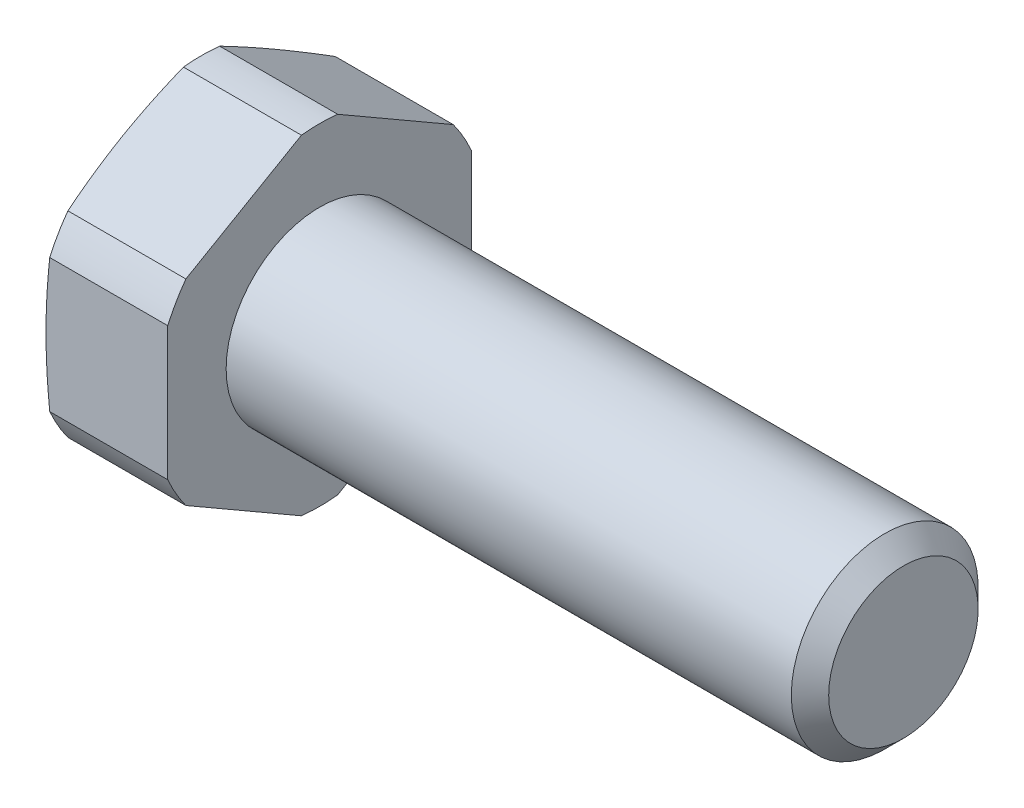
ISO-10303-21;
HEADER;
FILE_DESCRIPTION(('STEP AP214'),'2;1');
FILE_NAME('part.step','',(''),(''),'','','');
FILE_SCHEMA(('AUTOMOTIVE_DESIGN { 1 0 10303 214 1 1 1 1 }'));
ENDSEC;
DATA;
#1=APPLICATION_CONTEXT('core data for automotive mechanical design processes');
#2=APPLICATION_PROTOCOL_DEFINITION('international standard','automotive_design',2000,#1);
#3=PRODUCT_CONTEXT('',#1,'mechanical');
#4=PRODUCT('Part','Part','',(#3));
#5=PRODUCT_RELATED_PRODUCT_CATEGORY('part','',(#4));
#6=PRODUCT_DEFINITION_FORMATION('','',#4);
#7=PRODUCT_DEFINITION_CONTEXT('part definition',#1,'design');
#8=PRODUCT_DEFINITION('design','',#6,#7);
#9=PRODUCT_DEFINITION_SHAPE('','',#8);
#10=(LENGTH_UNIT() NAMED_UNIT(*) SI_UNIT(.MILLI.,.METRE.));
#11=(NAMED_UNIT(*) PLANE_ANGLE_UNIT() SI_UNIT($,.RADIAN.));
#12=(NAMED_UNIT(*) SI_UNIT($,.STERADIAN.) SOLID_ANGLE_UNIT());
#13=UNCERTAINTY_MEASURE_WITH_UNIT(LENGTH_MEASURE(1.E-05),#10,'distance_accuracy_value','');
#14=(GEOMETRIC_REPRESENTATION_CONTEXT(3) GLOBAL_UNCERTAINTY_ASSIGNED_CONTEXT((#13)) GLOBAL_UNIT_ASSIGNED_CONTEXT((#10,
#11,#12)) REPRESENTATION_CONTEXT('',''));
#15=CARTESIAN_POINT('',(0.,0.,0.));
#16=DIRECTION('',(0.,0.,1.));
#17=DIRECTION('',(1.,0.,0.));
#18=AXIS2_PLACEMENT_3D('',#15,#16,#17);
#19=CARTESIAN_POINT('',(-5.05214699700121,0.,0.));
#20=DIRECTION('',(1.,0.,0.));
#21=DIRECTION('',(0.,0.,-1.));
#22=AXIS2_PLACEMENT_3D('',#19,#20,#21);
#23=CONICAL_SURFACE('',#22,7.1,1.30899693899575);
#24=CARTESIAN_POINT('',(-5.3,0.,0.));
#25=DIRECTION('',(-1.,0.,0.));
#26=DIRECTION('',(0.,0.,1.));
#27=AXIS2_PLACEMENT_3D('',#24,#25,#26);
#28=CIRCLE('',#27,6.175);
#29=CARTESIAN_POINT('',(-5.3,0.,6.17500000000001));
#30=VERTEX_POINT('',#29);
#31=EDGE_CURVE('E136',#30,#30,#28,.T.);
#32=ORIENTED_EDGE('',*,*,#31,.F.);
#33=EDGE_LOOP('',(#32));
#34=FACE_BOUND('',#33,.T.);
#35=CARTESIAN_POINT('',(-5.05194699700121,4.19995209101871,-5.72546958900048));
#36=CARTESIAN_POINT('',(-5.07760027496934,4.31878271807584,-5.51964890544198));
#37=CARTESIAN_POINT('',(-5.10057398869215,4.43776618363337,-5.31356349783559));
#38=CARTESIAN_POINT('',(-5.14056478113447,4.67600028246664,-4.9009299345609));
#39=CARTESIAN_POINT('',(-5.15758094438379,4.79525095397173,-4.6943817126774));
#40=CARTESIAN_POINT('',(-5.18500732267837,5.03356593868456,-4.2816080509498));
#41=CARTESIAN_POINT('',(-5.19543831566373,5.15262964360163,-4.07538366469604));
#42=CARTESIAN_POINT('',(-5.20939266077504,5.39085061213858,-3.66277284376177));
#43=CARTESIAN_POINT('',(-5.21291651245995,5.51000786836872,-3.45638642188067));
#44=CARTESIAN_POINT('',(-5.21291651245994,5.748322380829,-3.04361357811845));
#45=CARTESIAN_POINT('',(-5.20939266077503,5.86747963705914,-2.83722715623734));
#46=CARTESIAN_POINT('',(-5.19543831566371,6.1057006055961,-2.42461633530308));
#47=CARTESIAN_POINT('',(-5.18500732267833,6.22476431051317,-2.21839194904933));
#48=CARTESIAN_POINT('',(-5.15758094438374,6.46307929522598,-1.80561828732172));
#49=CARTESIAN_POINT('',(-5.14056478113442,6.58232996673106,-1.59907006543821));
#50=CARTESIAN_POINT('',(-5.10057398869209,6.82056406556438,-1.18643650216356));
#51=CARTESIAN_POINT('',(-5.07760027496928,6.939547531122,-0.980351094557216));
#52=CARTESIAN_POINT('',(-5.05194699700116,7.05837815817933,-0.774530410998828));
#53=B_SPLINE_CURVE_WITH_KNOTS('',3,(#35,#36,#37,#38,#39,#40,#41,#42,#43,#44,#45,#46,#47,#48,#49,
#50,#51,#52),.UNSPECIFIED.,.F.,.F.,(4,2,2,2,2,2,2,2,4),(0.,0.717134619479373,1.43437938951788,
2.14934960199482,2.86426810234601,3.57918660269719,4.29415681517413,5.01140158521264,
5.72853620469201),.UNSPECIFIED.);
#54=CARTESIAN_POINT('',(-5.05214699700121,4.20087943889028,-5.72386337537059));
#55=VERTEX_POINT('',#54);
#56=CARTESIAN_POINT('',(-5.05214699700121,7.05745081030744,-0.776136624629012));
#57=VERTEX_POINT('',#56);
#58=EDGE_CURVE('E208',#55,#57,#53,.T.);
#59=ORIENTED_EDGE('',*,*,#58,.F.);
#60=CARTESIAN_POINT('',(-5.05214699700121,0.,0.));
#61=DIRECTION('',(-1.,0.,0.));
#62=DIRECTION('',(0.,0.,1.));
#63=AXIS2_PLACEMENT_3D('',#60,#61,#62);
#64=CIRCLE('',#63,7.1);
#65=CARTESIAN_POINT('',(-5.05214699700121,2.85657137141702,-6.4999999999998));
#66=VERTEX_POINT('',#65);
#67=EDGE_CURVE('E291',#55,#66,#64,.T.);
#68=ORIENTED_EDGE('',*,*,#67,.T.);
#69=CARTESIAN_POINT('',(-3.77950089472176,-9.90770125370262,-6.49999999999994));
#70=CARTESIAN_POINT('',(-3.84549923221781,-9.61303683004892,-6.49999999999971));
#71=CARTESIAN_POINT('',(-3.9106870830531,-9.31818755285972,-6.49999999999963));
#72=CARTESIAN_POINT('',(-4.03900435606368,-8.72802854950372,-6.49999999999956));
#73=CARTESIAN_POINT('',(-4.10213368872083,-8.43271880389624,-6.49999999999958));
#74=CARTESIAN_POINT('',(-4.22595195035637,-7.84128094408389,-6.4999999999996));
#75=CARTESIAN_POINT('',(-4.28663840023632,-7.54515230901562,-6.49999999999959));
#76=CARTESIAN_POINT('',(-4.40491269371641,-6.95227722725175,-6.49999999999959));
#77=CARTESIAN_POINT('',(-4.4625005636794,-6.65553078583479,-6.49999999999959));
#78=CARTESIAN_POINT('',(-4.57339453337865,-6.06368986807942,-6.49999999999959));
#79=CARTESIAN_POINT('',(-4.62673117435121,-5.76860114266193,-6.49999999999959));
#80=CARTESIAN_POINT('',(-4.72872616796684,-5.17761769171756,-6.49999999999959));
#81=CARTESIAN_POINT('',(-4.77738462407631,-4.88172298416532,-6.49999999999961));
#82=CARTESIAN_POINT('',(-4.86892350982998,-4.28907239039303,-6.49999999999958));
#83=CARTESIAN_POINT('',(-4.91180468331163,-3.99231662007223,-6.49999999999953));
#84=CARTESIAN_POINT('',(-4.99052177949509,-3.39786141661485,-6.49999999999965));
#85=CARTESIAN_POINT('',(-5.02635769642819,-3.10016198270579,-6.49999999999981));
#86=CARTESIAN_POINT('',(-5.08996536212495,-2.50046834328475,-6.49999999999981));
#87=CARTESIAN_POINT('',(-5.11764085308351,-2.19846377390432,-6.49999999999965));
#88=CARTESIAN_POINT('',(-5.16301575116542,-1.59369968950727,-6.49999999999953));
#89=CARTESIAN_POINT('',(-5.18071538706173,-1.29094019196311,-6.49999999999958));
#90=CARTESIAN_POINT('',(-5.20510605570851,-0.685105061534446,-6.49999999999961));
#91=CARTESIAN_POINT('',(-5.21180202439845,-0.382029631451896,-6.4999999999996));
#92=CARTESIAN_POINT('',(-5.21377415859091,0.224158974521434,-6.49999999999959));
#93=CARTESIAN_POINT('',(-5.20905033033124,0.527272150391506,-6.49999999999959));
#94=CARTESIAN_POINT('',(-5.18844845784139,1.13421773965112,-6.49999999999959));
#95=CARTESIAN_POINT('',(-5.17252981467405,1.43804874687813,-6.49999999999959));
#96=CARTESIAN_POINT('',(-5.13044490350307,2.04499361527503,-6.49999999999959));
#97=CARTESIAN_POINT('',(-5.10427841006827,2.34810746052128,-6.49999999999961));
#98=CARTESIAN_POINT('',(-5.04301462259288,2.95361619476181,-6.49999999999957));
#99=CARTESIAN_POINT('',(-5.00791153851854,3.25601048886066,-6.49999999999953));
#100=CARTESIAN_POINT('',(-4.93022920552256,3.85982662819234,-6.49999999999965));
#101=CARTESIAN_POINT('',(-4.88764993371117,4.16124847044493,-6.4999999999998));
#102=CARTESIAN_POINT('',(-4.79942061262062,4.74304526391531,-6.49999999999979));
#103=CARTESIAN_POINT('',(-4.75416585471337,5.02348076975651,-6.49999999999964));
#104=CARTESIAN_POINT('',(-4.65928179773914,5.58361433540157,-6.49999999999954));
#105=CARTESIAN_POINT('',(-4.60965238023534,5.86331237502846,-6.49999999999958));
#106=CARTESIAN_POINT('',(-4.50681836335416,6.42207301698542,-6.4999999999996));
#107=CARTESIAN_POINT('',(-4.45361344604542,6.70113556052046,-6.49999999999959));
#108=CARTESIAN_POINT('',(-4.34428024606986,7.25868877975134,-6.49999999999959));
#109=CARTESIAN_POINT('',(-4.28815192576304,7.53717944803604,-6.49999999999959));
#110=CARTESIAN_POINT('',(-4.1161751327369,8.37203815656093,-6.49999999999959));
#111=CARTESIAN_POINT('',(-3.9967579068585,8.92767029566493,-6.49999999999959));
#112=CARTESIAN_POINT('',(-3.75146990372675,10.0374595472311,-6.49999999999959));
#113=CARTESIAN_POINT('',(-3.62559950106506,10.5916167433504,-6.49999999999959));
#114=CARTESIAN_POINT('',(-3.37057620947709,11.6934057001811,-6.49999999999959));
#115=CARTESIAN_POINT('',(-3.24146803677526,12.2410478396252,-6.49999999999959));
#116=CARTESIAN_POINT('',(-2.98002169310481,13.3355686749826,-6.49999999999959));
#117=CARTESIAN_POINT('',(-2.8476834637139,13.8824473568976,-6.4999999999996));
#118=CARTESIAN_POINT('',(-2.58078319258942,14.9749505577545,-6.49999999999958));
#119=CARTESIAN_POINT('',(-2.44622407444435,15.5205757923582,-6.49999999999955));
#120=CARTESIAN_POINT('',(-2.17526847677977,16.611351157403,-6.49999999999962));
#121=CARTESIAN_POINT('',(-2.03887205773513,17.1565013028558,-6.49999999999972));
#122=CARTESIAN_POINT('',(-1.90182465532042,17.7014857538417,-6.49999999999996));
#123=B_SPLINE_CURVE_WITH_KNOTS('',3,(#69,#70,#71,#72,#73,#74,#75,#76,#77,#78,#79,#80,#81,#82,
#83,#84,#85,#86,#87,#88,#89,#90,#91,#92,#93,#94,#95,#96,#97,#98,#99,#100,#101,#102,#103,#104,
#105,#106,#107,#108,#109,#110,#111,#112,#113,#114,#115,#116,#117,#118,#119,#120,#121,#122),
.UNSPECIFIED.,.F.,.F.,(4,2,2,2,2,2,2,2,2,2,2,2,2,2,2,2,2,2,2,2,2,2,2,2,2,2,4),(0.,
0.905898920692884,1.81183718353165,2.71867275809952,3.62550061605081,4.52508121778619,
5.4246419191147,6.3240866891773,7.22353219570955,8.13319785926563,9.0428426609137,
9.95207930967695,10.8613154617895,11.7738661542407,12.6864369220163,13.5996004575466,
14.5127667889475,15.3649164610578,16.2170892108291,17.0693378358233,17.9215974365788,
19.6264908547874,21.3312854197707,23.0192370587519,24.7072192505043,26.3931331153492,
28.0789916231747),.UNSPECIFIED.);
#124=CARTESIAN_POINT('',(-5.05214699700124,-2.85657137141709,-6.49999999999971));
#125=VERTEX_POINT('',#124);
#126=EDGE_CURVE('E187',#125,#66,#123,.T.);
#127=ORIENTED_EDGE('',*,*,#126,.F.);
#128=CARTESIAN_POINT('',(-5.05214699700124,-4.20087943889029,-5.72386337537037));
#129=VERTEX_POINT('',#128);
#130=EDGE_CURVE('E186',#125,#129,#64,.T.);
#131=ORIENTED_EDGE('',*,*,#130,.T.);
#132=CARTESIAN_POINT('',(-5.05194699700121,-7.0583781581794,-0.7745304109988));
#133=CARTESIAN_POINT('',(-5.07760027496929,-6.93954753112202,-0.980351094557168));
#134=CARTESIAN_POINT('',(-5.10057398869209,-6.82056406556439,-1.1864365021635));
#135=CARTESIAN_POINT('',(-5.14056478113441,-6.58232996673104,-1.59907006543815));
#136=CARTESIAN_POINT('',(-5.15758094438374,-6.46307929522597,-1.80561828732167));
#137=CARTESIAN_POINT('',(-5.18500732267834,-6.22476431051316,-2.21839194904928));
#138=CARTESIAN_POINT('',(-5.19543831566371,-6.10570060559608,-2.42461633530304));
#139=CARTESIAN_POINT('',(-5.20939266077503,-5.86747963705913,-2.83722715623731));
#140=CARTESIAN_POINT('',(-5.21291651245994,-5.74832238082899,-3.04361357811842));
#141=CARTESIAN_POINT('',(-5.21291651245995,-5.5100078683687,-3.45638642188064));
#142=CARTESIAN_POINT('',(-5.20939266077504,-5.39085061213856,-3.66277284376175));
#143=CARTESIAN_POINT('',(-5.19543831566374,-5.15262964360161,-4.07538366469602));
#144=CARTESIAN_POINT('',(-5.18500732267838,-5.03356593868453,-4.28160805094978));
#145=CARTESIAN_POINT('',(-5.1575809443838,-4.79525095397171,-4.69438171267738));
#146=CARTESIAN_POINT('',(-5.14056478113448,-4.67600028246661,-4.90092993456089));
#147=CARTESIAN_POINT('',(-5.10057398869216,-4.43776618363333,-5.31356349783558));
#148=CARTESIAN_POINT('',(-5.07760027496935,-4.31878271807578,-5.51964890544196));
#149=CARTESIAN_POINT('',(-5.05194699700124,-4.1999520910186,-5.72546958900044));
#150=B_SPLINE_CURVE_WITH_KNOTS('',3,(#132,#133,#134,#135,#136,#137,#138,#139,#140,#141,#142,
#143,#144,#145,#146,#147,#148,#149),.UNSPECIFIED.,.F.,.F.,(4,2,2,2,2,2,2,2,4),(0.,
0.717134619479379,1.43437938951789,2.14934960199484,2.86426810234604,3.57918660269723,
4.29415681517419,5.0114015852127,5.72853620469208),.UNSPECIFIED.);
#151=CARTESIAN_POINT('',(-5.05214699700127,-7.05745081030751,-0.776136624629192));
#152=VERTEX_POINT('',#151);
#153=EDGE_CURVE('E273',#152,#129,#150,.T.);
#154=ORIENTED_EDGE('',*,*,#153,.F.);
#155=CARTESIAN_POINT('',(-5.05214699700124,-7.05745081030741,0.7761366246294));
#156=VERTEX_POINT('',#155);
#157=EDGE_CURVE('E293',#152,#156,#64,.T.);
#158=ORIENTED_EDGE('',*,*,#157,.T.);
#159=CARTESIAN_POINT('',(-5.05194699700124,-4.19995209101867,5.72546958900051));
#160=CARTESIAN_POINT('',(-5.07760027496929,-4.318782718076,5.51964890544213));
#161=CARTESIAN_POINT('',(-5.10057398869207,-4.43776618363361,5.3135634978358));
#162=CARTESIAN_POINT('',(-5.14056478113436,-4.67600028246691,4.90092993456117));
#163=CARTESIAN_POINT('',(-5.15758094438369,-4.79525095397198,4.69438171267767));
#164=CARTESIAN_POINT('',(-5.18500732267827,-5.03356593868478,4.2816080509501));
#165=CARTESIAN_POINT('',(-5.19543831566363,-5.15262964360184,4.07538366469635));
#166=CARTESIAN_POINT('',(-5.20939266077494,-5.39085061213878,3.66277284376211));
#167=CARTESIAN_POINT('',(-5.21291651245985,-5.51000786836892,3.45638642188102));
#168=CARTESIAN_POINT('',(-5.21291651245984,-5.74832238082918,3.04361357811883));
#169=CARTESIAN_POINT('',(-5.20939266077493,-5.86747963705932,2.83722715623774));
#170=CARTESIAN_POINT('',(-5.19543831566362,-6.10570060559625,2.4246163353035));
#171=CARTESIAN_POINT('',(-5.18500732267825,-6.22476431051332,2.21839194904976));
#172=CARTESIAN_POINT('',(-5.15758094438367,-6.46307929522612,1.80561828732218));
#173=CARTESIAN_POINT('',(-5.14056478113434,-6.58232996673119,1.59907006543868));
#174=CARTESIAN_POINT('',(-5.10057398869203,-6.82056406556449,1.18643650216405));
#175=CARTESIAN_POINT('',(-5.07760027496925,-6.93954753112208,0.980351094557713));
#176=CARTESIAN_POINT('',(-5.05194699700118,-7.05837815817938,0.774530410999313));
#177=B_SPLINE_CURVE_WITH_KNOTS('',3,(#159,#160,#161,#162,#163,#164,#165,#166,#167,#168,#169,
#170,#171,#172,#173,#174,#175,#176),.UNSPECIFIED.,.F.,.F.,(4,2,2,2,2,2,2,2,4),(0.,
0.717134619479323,1.43437938951778,2.14934960199468,2.86426810234581,3.57918660269695,
4.29415681517385,5.01140158521231,5.72853620469163),.UNSPECIFIED.);
#178=CARTESIAN_POINT('',(-5.05214699700124,-4.20087943889028,5.72386337537056));
#179=VERTEX_POINT('',#178);
#180=EDGE_CURVE('E262',#179,#156,#177,.T.);
#181=ORIENTED_EDGE('',*,*,#180,.F.);
#182=CARTESIAN_POINT('',(-5.05214699700124,-2.85657137141719,6.50000000000008));
#183=VERTEX_POINT('',#182);
#184=EDGE_CURVE('E154',#179,#183,#64,.T.);
#185=ORIENTED_EDGE('',*,*,#184,.T.);
#186=CARTESIAN_POINT('',(-3.77950089472174,-9.90770125370274,6.50000000000027));
#187=CARTESIAN_POINT('',(-3.84549923221772,-9.61303683004902,6.5000000000003));
#188=CARTESIAN_POINT('',(-3.91068708305298,-9.31818755285982,6.50000000000031));
#189=CARTESIAN_POINT('',(-4.03900435606353,-8.72802854950381,6.50000000000032));
#190=CARTESIAN_POINT('',(-4.10213368872069,-8.43271880389633,6.50000000000031));
#191=CARTESIAN_POINT('',(-4.22595195035623,-7.84128094408398,6.50000000000031));
#192=CARTESIAN_POINT('',(-4.28663840023618,-7.5451523090157,6.50000000000031));
#193=CARTESIAN_POINT('',(-4.40491269371626,-6.95227722725182,6.50000000000031));
#194=CARTESIAN_POINT('',(-4.46250056367925,-6.65553078583486,6.50000000000031));
#195=CARTESIAN_POINT('',(-4.5733945333785,-6.06368986807948,6.50000000000031));
#196=CARTESIAN_POINT('',(-4.62673117435105,-5.76860114266198,6.50000000000031));
#197=CARTESIAN_POINT('',(-4.72872616796669,-5.1776176917176,6.50000000000031));
#198=CARTESIAN_POINT('',(-4.77738462407616,-4.88172298416536,6.50000000000031));
#199=CARTESIAN_POINT('',(-4.8689235098298,-4.28907239039307,6.50000000000031));
#200=CARTESIAN_POINT('',(-4.9118046833114,-3.99231662007226,6.50000000000033));
#201=CARTESIAN_POINT('',(-4.99052177949497,-3.39786141661488,6.5000000000003));
#202=CARTESIAN_POINT('',(-5.02635769642822,-3.10016198270584,6.50000000000026));
#203=CARTESIAN_POINT('',(-5.08996536212497,-2.50046834328482,6.50000000000025));
#204=CARTESIAN_POINT('',(-5.11764085308337,-2.19846377390439,6.50000000000029));
#205=CARTESIAN_POINT('',(-5.16301575116517,-1.59369968950734,6.50000000000032));
#206=CARTESIAN_POINT('',(-5.18071538706152,-1.29094019196319,6.50000000000031));
#207=CARTESIAN_POINT('',(-5.20510605570833,-0.685105061534552,6.50000000000031));
#208=CARTESIAN_POINT('',(-5.21180202439826,-0.382029631452007,6.50000000000031));
#209=CARTESIAN_POINT('',(-5.21377415859071,0.22415897452131,6.50000000000031));
#210=CARTESIAN_POINT('',(-5.20905033033105,0.527272150391373,6.50000000000031));
#211=CARTESIAN_POINT('',(-5.18844845784121,1.13421773965097,6.50000000000031));
#212=CARTESIAN_POINT('',(-5.17252981467387,1.43804874687797,6.50000000000031));
#213=CARTESIAN_POINT('',(-5.1304449035029,2.04499361527486,6.50000000000031));
#214=CARTESIAN_POINT('',(-5.10427841006811,2.34810746052111,6.5000000000003));
#215=CARTESIAN_POINT('',(-5.04301462259272,2.95361619476162,6.50000000000032));
#216=CARTESIAN_POINT('',(-5.00791153851836,3.25601048886047,6.50000000000034));
#217=CARTESIAN_POINT('',(-4.93022920552246,3.85982662819214,6.50000000000028));
#218=CARTESIAN_POINT('',(-4.88764993371117,4.16124847044474,6.5000000000002));
#219=CARTESIAN_POINT('',(-4.79942061262062,4.7430452639151,6.5000000000002));
#220=CARTESIAN_POINT('',(-4.75416585471329,5.02348076975629,6.50000000000028));
#221=CARTESIAN_POINT('',(-4.659281797739,5.58361433540135,6.50000000000034));
#222=CARTESIAN_POINT('',(-4.60965238023523,5.86331237502824,6.50000000000032));
#223=CARTESIAN_POINT('',(-4.50681836335407,6.4220730169852,6.5000000000003));
#224=CARTESIAN_POINT('',(-4.45361344604533,6.70113556052025,6.50000000000031));
#225=CARTESIAN_POINT('',(-4.34428024606977,7.25868877975113,6.50000000000031));
#226=CARTESIAN_POINT('',(-4.28815192576295,7.53717944803583,6.50000000000031));
#227=CARTESIAN_POINT('',(-4.11617513273683,8.37203815656074,6.50000000000031));
#228=CARTESIAN_POINT('',(-3.99675790685842,8.92767029566475,6.50000000000031));
#229=CARTESIAN_POINT('',(-3.75146990372668,10.037459547231,6.50000000000031));
#230=CARTESIAN_POINT('',(-3.62559950106499,10.5916167433502,6.50000000000031));
#231=CARTESIAN_POINT('',(-3.37057620947703,11.6934057001809,6.50000000000031));
#232=CARTESIAN_POINT('',(-3.2414680367752,12.2410478396251,6.50000000000031));
#233=CARTESIAN_POINT('',(-2.98002169310476,13.3355686749824,6.5000000000003));
#234=CARTESIAN_POINT('',(-2.84768346371385,13.8824473568974,6.5000000000003));
#235=CARTESIAN_POINT('',(-2.58078319258937,14.9749505577543,6.50000000000031));
#236=CARTESIAN_POINT('',(-2.44622407444431,15.5205757923581,6.50000000000033));
#237=CARTESIAN_POINT('',(-2.17526847677973,16.6113511574029,6.50000000000029));
#238=CARTESIAN_POINT('',(-2.03887205773509,17.1565013028557,6.50000000000023));
#239=CARTESIAN_POINT('',(-1.9018246553204,17.7014857538416,6.50000000000009));
#240=B_SPLINE_CURVE_WITH_KNOTS('',3,(#186,#187,#188,#189,#190,#191,#192,#193,#194,#195,#196,
#197,#198,#199,#200,#201,#202,#203,#204,#205,#206,#207,#208,#209,#210,#211,#212,#213,#214,#215,
#216,#217,#218,#219,#220,#221,#222,#223,#224,#225,#226,#227,#228,#229,#230,#231,#232,#233,#234,
#235,#236,#237,#238,#239),.UNSPECIFIED.,.F.,.F.,(4,2,2,2,2,2,2,2,2,2,2,2,2,2,2,2,2,2,2,2,2,2,2,
2,2,2,4),(0.,0.905898920692886,1.81183718353166,2.71867275809954,3.62550061605085,
4.52508121778624,5.42464191911476,6.32408668917736,7.22353219570961,8.13319785926565,
9.0428426609137,9.95207930967693,10.8613154617895,11.7738661542407,12.6864369220162,
13.5996004575465,14.5127667889474,15.3649164610576,16.217089210829,17.0693378358232,
17.9215974365786,19.6264908547873,21.3312854197706,23.0192370587518,24.7072192505043,
26.3931331153492,28.0789916231746),.UNSPECIFIED.);
#241=CARTESIAN_POINT('',(-5.05214699700121,2.85657137141719,6.50000000000014));
#242=VERTEX_POINT('',#241);
#243=EDGE_CURVE('E245',#242,#183,#240,.F.);
#244=ORIENTED_EDGE('',*,*,#243,.F.);
#245=CARTESIAN_POINT('',(-5.05214699700121,4.20087943889034,5.72386337537067));
#246=VERTEX_POINT('',#245);
#247=EDGE_CURVE('E162',#242,#246,#64,.T.);
#248=ORIENTED_EDGE('',*,*,#247,.T.);
#249=CARTESIAN_POINT('',(-5.05194699700116,7.05837815817938,0.774530410999077));
#250=CARTESIAN_POINT('',(-5.07760027496923,6.93954753112216,0.980351094557536));
#251=CARTESIAN_POINT('',(-5.10057398869202,6.8205640655646,1.1864365021639));
#252=CARTESIAN_POINT('',(-5.14056478113432,6.58232996673131,1.59907006543857));
#253=CARTESIAN_POINT('',(-5.15758094438365,6.46307929522623,1.80561828732208));
#254=CARTESIAN_POINT('',(-5.18500732267824,6.22476431051341,2.21839194904967));
#255=CARTESIAN_POINT('',(-5.19543831566361,6.10570060559634,2.42461633530342));
#256=CARTESIAN_POINT('',(-5.20939266077493,5.86747963705939,2.83722715623769));
#257=CARTESIAN_POINT('',(-5.21291651245984,5.74832238082925,3.04361357811879));
#258=CARTESIAN_POINT('',(-5.21291651245984,5.51000786836897,3.456386421881));
#259=CARTESIAN_POINT('',(-5.20939266077493,5.39085061213883,3.66277284376211));
#260=CARTESIAN_POINT('',(-5.19543831566363,5.15262964360188,4.07538366469637));
#261=CARTESIAN_POINT('',(-5.18500732267826,5.03356593868481,4.28160805095012));
#262=CARTESIAN_POINT('',(-5.15758094438368,4.795250953972,4.69438171267772));
#263=CARTESIAN_POINT('',(-5.14056478113436,4.67600028246693,4.90092993456123));
#264=CARTESIAN_POINT('',(-5.10057398869206,4.43776618363361,5.31356349783588));
#265=CARTESIAN_POINT('',(-5.07760027496927,4.318782718076,5.51964890544222));
#266=CARTESIAN_POINT('',(-5.05194699700121,4.19995209101869,5.72546958900062));
#267=B_SPLINE_CURVE_WITH_KNOTS('',3,(#249,#250,#251,#252,#253,#254,#255,#256,#257,#258,#259,
#260,#261,#262,#263,#264,#265,#266),.UNSPECIFIED.,.F.,.F.,(4,2,2,2,2,2,2,2,4),(0.,
0.717134619479359,1.43437938951785,2.14934960199479,2.86426810234596,3.57918660269714,
4.29415681517408,5.01140158521257,5.72853620469193),.UNSPECIFIED.);
#268=CARTESIAN_POINT('',(-5.05214699700121,7.05745081030745,0.776136624629484));
#269=VERTEX_POINT('',#268);
#270=EDGE_CURVE('E146',#269,#246,#267,.T.);
#271=ORIENTED_EDGE('',*,*,#270,.F.);
#272=EDGE_CURVE('E145',#269,#57,#64,.T.);
#273=ORIENTED_EDGE('',*,*,#272,.T.);
#274=EDGE_LOOP('',(#59,#68,#127,#131,#154,#158,#181,#185,#244,#248,#271,#273));
#275=FACE_BOUND('',#274,.T.);
#276=ADVANCED_FACE('F37',(#34,#275),#23,.T.);
#277=CARTESIAN_POINT('',(-1000.,-4.30211422042248E-13,1.11022302462516E-13));
#278=DIRECTION('',(-1.,0.,0.));
#279=DIRECTION('',(0.,0.,1.));
#280=AXIS2_PLACEMENT_3D('',#277,#278,#279);
#281=CYLINDRICAL_SURFACE('',#280,7.1);
#282=DIRECTION('',(-1.,0.,0.));
#283=VECTOR('',#282,1.);
#284=CARTESIAN_POINT('',(-1000.,4.20087943888968,-5.72386337537037));
#285=LINE('',#284,#283);
#286=CARTESIAN_POINT('',(0.,4.20087943889026,-5.72386337537043));
#287=VERTEX_POINT('',#286);
#288=EDGE_CURVE('E217',#287,#55,#285,.T.);
#289=ORIENTED_EDGE('',*,*,#288,.F.);
#290=CARTESIAN_POINT('',(0.,0.,0.));
#291=DIRECTION('',(-1.,0.,0.));
#292=DIRECTION('',(0.,0.,1.));
#293=AXIS2_PLACEMENT_3D('',#290,#291,#292);
#294=CIRCLE('',#293,7.1);
#295=CARTESIAN_POINT('',(0.,2.85657137141697,-6.49999999999974));
#296=VERTEX_POINT('',#295);
#297=EDGE_CURVE('E152',#287,#296,#294,.T.);
#298=ORIENTED_EDGE('',*,*,#297,.T.);
#299=DIRECTION('',(-1.,0.,0.));
#300=VECTOR('',#299,1.);
#301=CARTESIAN_POINT('',(-1000.,2.85657137141666,-6.49999999999973));
#302=LINE('',#301,#300);
#303=EDGE_CURVE('E178',#66,#296,#302,.F.);
#304=ORIENTED_EDGE('',*,*,#303,.F.);
#305=ORIENTED_EDGE('',*,*,#67,.F.);
#306=EDGE_LOOP('',(#289,#298,#304,#305));
#307=FACE_BOUND('',#306,.T.);
#308=ADVANCED_FACE('F292',(#307),#281,.T.);
#309=DIRECTION('',(-1.,0.,0.));
#310=VECTOR('',#309,1.);
#311=CARTESIAN_POINT('',(-1000.,7.05745081030695,-0.776136624629151));
#312=LINE('',#311,#310);
#313=CARTESIAN_POINT('',(0.,7.0574508103074,-0.776136624629262));
#314=VERTEX_POINT('',#313);
#315=EDGE_CURVE('E284',#57,#314,#312,.F.);
#316=ORIENTED_EDGE('',*,*,#315,.F.);
#317=ORIENTED_EDGE('',*,*,#272,.F.);
#318=DIRECTION('',(-1.,0.,0.));
#319=VECTOR('',#318,1.);
#320=CARTESIAN_POINT('',(-1000.,7.05745081030688,0.776136624629623));
#321=LINE('',#320,#319);
#322=CARTESIAN_POINT('',(0.,7.05745081030745,0.7761366246294));
#323=VERTEX_POINT('',#322);
#324=EDGE_CURVE('E127',#323,#269,#321,.T.);
#325=ORIENTED_EDGE('',*,*,#324,.F.);
#326=EDGE_CURVE('E143',#323,#314,#294,.T.);
#327=ORIENTED_EDGE('',*,*,#326,.T.);
#328=EDGE_LOOP('',(#316,#317,#325,#327));
#329=FACE_BOUND('',#328,.T.);
#330=ADVANCED_FACE('F142',(#329),#281,.T.);
#331=DIRECTION('',(-1.,0.,0.));
#332=VECTOR('',#331,1.);
#333=CARTESIAN_POINT('',(-1000.,-2.8565713714177,-6.49999999999967));
#334=LINE('',#333,#332);
#335=CARTESIAN_POINT('',(0.,-2.85657137141711,-6.49999999999971));
#336=VERTEX_POINT('',#335);
#337=EDGE_CURVE('E175',#336,#125,#334,.T.);
#338=ORIENTED_EDGE('',*,*,#337,.F.);
#339=CARTESIAN_POINT('',(0.,-4.20087943889043,-5.72386337537043));
#340=VERTEX_POINT('',#339);
#341=EDGE_CURVE('E157',#336,#340,#294,.T.);
#342=ORIENTED_EDGE('',*,*,#341,.T.);
#343=DIRECTION('',(-1.,0.,0.));
#344=VECTOR('',#343,1.);
#345=CARTESIAN_POINT('',(-1000.,-4.20087943889085,-5.72386337537036));
#346=LINE('',#345,#344);
#347=EDGE_CURVE('E268',#129,#340,#346,.F.);
#348=ORIENTED_EDGE('',*,*,#347,.F.);
#349=ORIENTED_EDGE('',*,*,#130,.F.);
#350=EDGE_LOOP('',(#338,#342,#348,#349));
#351=FACE_BOUND('',#350,.T.);
#352=ADVANCED_FACE('F183',(#351),#281,.T.);
#353=DIRECTION('',(-1.,0.,0.));
#354=VECTOR('',#353,1.);
#355=CARTESIAN_POINT('',(-1000.,-7.05745081030791,-0.776136624629137));
#356=LINE('',#355,#354);
#357=CARTESIAN_POINT('',(0.,-7.05745081030745,-0.776136624629262));
#358=VERTEX_POINT('',#357);
#359=EDGE_CURVE('E271',#358,#152,#356,.T.);
#360=ORIENTED_EDGE('',*,*,#359,.F.);
#361=CARTESIAN_POINT('',(0.,-7.05745081030741,0.7761366246294));
#362=VERTEX_POINT('',#361);
#363=EDGE_CURVE('E191',#358,#362,#294,.T.);
#364=ORIENTED_EDGE('',*,*,#363,.T.);
#365=DIRECTION('',(-1.,0.,0.));
#366=VECTOR('',#365,1.);
#367=CARTESIAN_POINT('',(-1000.,-7.05745081030794,0.776136624629623));
#368=LINE('',#367,#366);
#369=EDGE_CURVE('E60',#156,#362,#368,.F.);
#370=ORIENTED_EDGE('',*,*,#369,.F.);
#371=ORIENTED_EDGE('',*,*,#157,.F.);
#372=EDGE_LOOP('',(#360,#364,#370,#371));
#373=FACE_BOUND('',#372,.T.);
#374=ADVANCED_FACE('F312',(#373),#281,.T.);
#375=DIRECTION('',(-1.,0.,0.));
#376=VECTOR('',#375,1.);
#377=CARTESIAN_POINT('',(-1000.,-4.20087943889082,5.72386337537094));
#378=LINE('',#377,#376);
#379=CARTESIAN_POINT('',(0.,-4.2008794388903,5.72386337537058));
#380=VERTEX_POINT('',#379);
#381=EDGE_CURVE('E269',#380,#179,#378,.T.);
#382=ORIENTED_EDGE('',*,*,#381,.F.);
#383=CARTESIAN_POINT('',(0.,-2.85657137141727,6.50000000000017));
#384=VERTEX_POINT('',#383);
#385=EDGE_CURVE('E155',#380,#384,#294,.T.);
#386=ORIENTED_EDGE('',*,*,#385,.T.);
#387=DIRECTION('',(-1.,0.,0.));
#388=VECTOR('',#387,1.);
#389=CARTESIAN_POINT('',(-1000.,-2.85657137141755,6.5000000000002));
#390=LINE('',#389,#388);
#391=EDGE_CURVE('E52',#183,#384,#390,.F.);
#392=ORIENTED_EDGE('',*,*,#391,.F.);
#393=ORIENTED_EDGE('',*,*,#184,.F.);
#394=EDGE_LOOP('',(#382,#386,#392,#393));
#395=FACE_BOUND('',#394,.T.);
#396=ADVANCED_FACE('F302',(#395),#281,.T.);
#397=DIRECTION('',(-1.,0.,0.));
#398=VECTOR('',#397,1.);
#399=CARTESIAN_POINT('',(-1000.,2.85657137141669,6.50000000000031));
#400=LINE('',#399,#398);
#401=CARTESIAN_POINT('',(0.,2.85657137141711,6.50000000000014));
#402=VERTEX_POINT('',#401);
#403=EDGE_CURVE('E243',#402,#242,#400,.T.);
#404=ORIENTED_EDGE('',*,*,#403,.F.);
#405=CARTESIAN_POINT('',(0.,4.20087943889033,5.72386337537058));
#406=VERTEX_POINT('',#405);
#407=EDGE_CURVE('E151',#402,#406,#294,.T.);
#408=ORIENTED_EDGE('',*,*,#407,.T.);
#409=DIRECTION('',(-1.,0.,0.));
#410=VECTOR('',#409,1.);
#411=CARTESIAN_POINT('',(-1000.,4.20087943888978,5.72386337537081));
#412=LINE('',#411,#410);
#413=EDGE_CURVE('E130',#246,#406,#412,.F.);
#414=ORIENTED_EDGE('',*,*,#413,.F.);
#415=ORIENTED_EDGE('',*,*,#247,.F.);
#416=EDGE_LOOP('',(#404,#408,#414,#415));
#417=FACE_BOUND('',#416,.T.);
#418=ADVANCED_FACE('F305',(#417),#281,.T.);
#419=CARTESIAN_POINT('',(0.,7.1,0.));
#420=DIRECTION('',(-1.,0.,0.));
#421=DIRECTION('',(0.,0.,1.));
#422=AXIS2_PLACEMENT_3D('',#419,#420,#421);
#423=PLANE('',#422);
#424=CARTESIAN_POINT('',(0.,0.,0.));
#425=DIRECTION('',(-1.,0.,0.));
#426=DIRECTION('',(0.,0.,1.));
#427=AXIS2_PLACEMENT_3D('',#424,#425,#426);
#428=CIRCLE('',#427,4.);
#429=CARTESIAN_POINT('',(0.,0.,4.00000000000001));
#430=VERTEX_POINT('',#429);
#431=EDGE_CURVE('E160',#430,#430,#428,.T.);
#432=ORIENTED_EDGE('',*,*,#431,.T.);
#433=EDGE_LOOP('',(#432));
#434=FACE_BOUND('',#433,.T.);
#435=DIRECTION('',(0.,-0.5,-0.86602540378444));
#436=VECTOR('',#435,1.);
#437=CARTESIAN_POINT('',(0.,7.40416512459889,-0.175609816565128));
#438=LINE('',#437,#436);
#439=EDGE_CURVE('E12',#314,#287,#438,.T.);
#440=ORIENTED_EDGE('',*,*,#439,.F.);
#441=ORIENTED_EDGE('',*,*,#326,.F.);
#442=DIRECTION('',(0.,0.5,-0.86602540378444));
#443=VECTOR('',#442,1.);
#444=CARTESIAN_POINT('',(0.,7.40416512459885,0.175609816565225));
#445=LINE('',#444,#443);
#446=EDGE_CURVE('E124',#406,#323,#445,.T.);
#447=ORIENTED_EDGE('',*,*,#446,.F.);
#448=ORIENTED_EDGE('',*,*,#407,.F.);
#449=DIRECTION('',(0.,1.,0.));
#450=VECTOR('',#449,1.);
#451=CARTESIAN_POINT('',(0.,7.10000000000005,6.50000000000009));
#452=LINE('',#451,#450);
#453=EDGE_CURVE('E135',#384,#402,#452,.T.);
#454=ORIENTED_EDGE('',*,*,#453,.F.);
#455=ORIENTED_EDGE('',*,*,#385,.F.);
#456=DIRECTION('',(0.,0.5,0.86602540378444));
#457=VECTOR('',#456,1.);
#458=CARTESIAN_POINT('',(0.,-3.8541651245988,6.32439018343486));
#459=LINE('',#458,#457);
#460=EDGE_CURVE('E168',#362,#380,#459,.T.);
#461=ORIENTED_EDGE('',*,*,#460,.F.);
#462=ORIENTED_EDGE('',*,*,#363,.F.);
#463=DIRECTION('',(0.,-0.5,0.86602540378444));
#464=VECTOR('',#463,1.);
#465=CARTESIAN_POINT('',(0.,-3.85416512459892,-6.32439018343477));
#466=LINE('',#465,#464);
#467=EDGE_CURVE('E170',#340,#358,#466,.T.);
#468=ORIENTED_EDGE('',*,*,#467,.F.);
#469=ORIENTED_EDGE('',*,*,#341,.F.);
#470=DIRECTION('',(0.,-1.,0.));
#471=VECTOR('',#470,1.);
#472=CARTESIAN_POINT('',(0.,7.09999999999998,-6.49999999999991));
#473=LINE('',#472,#471);
#474=EDGE_CURVE('E45',#296,#336,#473,.T.);
#475=ORIENTED_EDGE('',*,*,#474,.F.);
#476=ORIENTED_EDGE('',*,*,#297,.F.);
#477=EDGE_LOOP('',(#440,#441,#447,#448,#454,#455,#461,#462,#468,#469,#475,#476));
#478=FACE_BOUND('',#477,.T.);
#479=ADVANCED_FACE('F149',(#434,#478),#423,.F.);
#480=CARTESIAN_POINT('',(-5.30000000000001,0.,0.));
#481=DIRECTION('',(1.,0.,0.));
#482=DIRECTION('',(0.,0.,-1.));
#483=AXIS2_PLACEMENT_3D('',#480,#481,#482);
#484=PLANE('',#483);
#485=ORIENTED_EDGE('',*,*,#31,.T.);
#486=EDGE_LOOP('',(#485));
#487=FACE_BOUND('',#486,.T.);
#488=ADVANCED_FACE('F39',(#487),#484,.F.);
#489=CARTESIAN_POINT('',(-1000.,-4.30211422042248E-13,1.11022302462516E-13));
#490=DIRECTION('',(-1.,0.,0.));
#491=DIRECTION('',(0.,0.,1.));
#492=AXIS2_PLACEMENT_3D('',#489,#490,#491);
#493=CYLINDRICAL_SURFACE('',#492,4.);
#494=ORIENTED_EDGE('',*,*,#431,.F.);
#495=EDGE_LOOP('',(#494));
#496=FACE_BOUND('',#495,.T.);
#497=CARTESIAN_POINT('',(24.1999999999999,0.,0.));
#498=DIRECTION('',(-1.,0.,0.));
#499=DIRECTION('',(0.,0.,1.));
#500=AXIS2_PLACEMENT_3D('',#497,#498,#499);
#501=CIRCLE('',#500,4.);
#502=CARTESIAN_POINT('',(24.1999999999999,0.,4.00000000000001));
#503=VERTEX_POINT('',#502);
#504=EDGE_CURVE('E200',#503,#503,#501,.T.);
#505=ORIENTED_EDGE('',*,*,#504,.T.);
#506=EDGE_LOOP('',(#505));
#507=FACE_BOUND('',#506,.T.);
#508=ADVANCED_FACE('F321',(#496,#507),#493,.T.);
#509=CARTESIAN_POINT('',(24.9999999999998,0.,0.));
#510=DIRECTION('',(-1.,0.,0.));
#511=DIRECTION('',(0.,0.,1.));
#512=AXIS2_PLACEMENT_3D('',#509,#510,#511);
#513=CONICAL_SURFACE('',#512,3.20000000000001,0.785398163397495);
#514=ORIENTED_EDGE('',*,*,#504,.F.);
#515=EDGE_LOOP('',(#514));
#516=FACE_BOUND('',#515,.T.);
#517=CARTESIAN_POINT('',(24.9999999999998,0.,0.));
#518=DIRECTION('',(-1.,0.,0.));
#519=DIRECTION('',(0.,0.,1.));
#520=AXIS2_PLACEMENT_3D('',#517,#518,#519);
#521=CIRCLE('',#520,3.20000000000001);
#522=CARTESIAN_POINT('',(24.9999999999998,0.,3.20000000000002));
#523=VERTEX_POINT('',#522);
#524=EDGE_CURVE('E204',#523,#523,#521,.T.);
#525=ORIENTED_EDGE('',*,*,#524,.T.);
#526=EDGE_LOOP('',(#525));
#527=FACE_BOUND('',#526,.T.);
#528=ADVANCED_FACE('F325',(#516,#527),#513,.T.);
#529=CARTESIAN_POINT('',(24.9999999999999,3.20000000000004,1.38777878078145E-13));
#530=DIRECTION('',(-1.,0.,0.));
#531=DIRECTION('',(0.,0.,1.));
#532=AXIS2_PLACEMENT_3D('',#529,#530,#531);
#533=PLANE('',#532);
#534=ORIENTED_EDGE('',*,*,#524,.F.);
#535=EDGE_LOOP('',(#534));
#536=FACE_BOUND('',#535,.T.);
#537=ADVANCED_FACE('F233',(#536),#533,.F.);
#538=CARTESIAN_POINT('',(45.8699663951175,3.75277674973264,6.50000000000019));
#539=DIRECTION('',(0.,0.866025403784439,0.5));
#540=DIRECTION('',(0.,-0.5,0.86602540378444));
#541=AXIS2_PLACEMENT_3D('',#538,#539,#540);
#542=PLANE('',#541);
#543=ORIENTED_EDGE('',*,*,#270,.T.);
#544=ORIENTED_EDGE('',*,*,#413,.T.);
#545=ORIENTED_EDGE('',*,*,#446,.T.);
#546=ORIENTED_EDGE('',*,*,#324,.T.);
#547=EDGE_LOOP('',(#543,#544,#545,#546));
#548=FACE_BOUND('',#547,.T.);
#549=ADVANCED_FACE('F126',(#548),#542,.T.);
#550=CARTESIAN_POINT('',(45.8699663951175,-3.75277674973253,6.50000000000031));
#551=DIRECTION('',(0.,0.,1.));
#552=DIRECTION('',(0.,-1.,0.));
#553=AXIS2_PLACEMENT_3D('',#550,#551,#552);
#554=PLANE('',#553);
#555=ORIENTED_EDGE('',*,*,#243,.T.);
#556=ORIENTED_EDGE('',*,*,#391,.T.);
#557=ORIENTED_EDGE('',*,*,#453,.T.);
#558=ORIENTED_EDGE('',*,*,#403,.T.);
#559=EDGE_LOOP('',(#555,#556,#557,#558));
#560=FACE_BOUND('',#559,.T.);
#561=ADVANCED_FACE('F232',(#560),#554,.T.);
#562=CARTESIAN_POINT('',(45.8699663951175,-7.50555349946519,2.22044604925031E-13));
#563=DIRECTION('',(0.,-0.866025403784438,0.500000000000001));
#564=DIRECTION('',(0.,-0.5,-0.86602540378444));
#565=AXIS2_PLACEMENT_3D('',#562,#563,#564);
#566=PLANE('',#565);
#567=ORIENTED_EDGE('',*,*,#180,.T.);
#568=ORIENTED_EDGE('',*,*,#369,.T.);
#569=ORIENTED_EDGE('',*,*,#460,.T.);
#570=ORIENTED_EDGE('',*,*,#381,.T.);
#571=EDGE_LOOP('',(#567,#568,#569,#570));
#572=FACE_BOUND('',#571,.T.);
#573=ADVANCED_FACE('F256',(#572),#566,.T.);
#574=CARTESIAN_POINT('',(45.8699663951175,-3.75277674973255,-6.49999999999958));
#575=DIRECTION('',(0.,-0.866025403784439,-0.500000000000001));
#576=DIRECTION('',(0.,0.5,-0.86602540378444));
#577=AXIS2_PLACEMENT_3D('',#574,#575,#576);
#578=PLANE('',#577);
#579=ORIENTED_EDGE('',*,*,#153,.T.);
#580=ORIENTED_EDGE('',*,*,#347,.T.);
#581=ORIENTED_EDGE('',*,*,#467,.T.);
#582=ORIENTED_EDGE('',*,*,#359,.T.);
#583=EDGE_LOOP('',(#579,#580,#581,#582));
#584=FACE_BOUND('',#583,.T.);
#585=ADVANCED_FACE('F259',(#584),#578,.T.);
#586=CARTESIAN_POINT('',(45.8699663951175,3.75277674973261,-6.49999999999959));
#587=DIRECTION('',(0.,0.,-1.));
#588=DIRECTION('',(-1.,0.,0.));
#589=AXIS2_PLACEMENT_3D('',#586,#587,#588);
#590=PLANE('',#589);
#591=ORIENTED_EDGE('',*,*,#126,.T.);
#592=ORIENTED_EDGE('',*,*,#303,.T.);
#593=ORIENTED_EDGE('',*,*,#474,.T.);
#594=ORIENTED_EDGE('',*,*,#337,.T.);
#595=EDGE_LOOP('',(#591,#592,#593,#594));
#596=FACE_BOUND('',#595,.T.);
#597=ADVANCED_FACE('F174',(#596),#590,.T.);
#598=CARTESIAN_POINT('',(45.8699663951175,7.50555349946502,2.63677968348475E-13));
#599=DIRECTION('',(0.,0.866025403784439,-0.500000000000001));
#600=DIRECTION('',(0.,0.5,0.86602540378444));
#601=AXIS2_PLACEMENT_3D('',#598,#599,#600);
#602=PLANE('',#601);
#603=ORIENTED_EDGE('',*,*,#58,.T.);
#604=ORIENTED_EDGE('',*,*,#315,.T.);
#605=ORIENTED_EDGE('',*,*,#439,.T.);
#606=ORIENTED_EDGE('',*,*,#288,.T.);
#607=EDGE_LOOP('',(#603,#604,#605,#606));
#608=FACE_BOUND('',#607,.T.);
#609=ADVANCED_FACE('F221',(#608),#602,.T.);
#610=CLOSED_SHELL('',(#276,#308,#330,#352,#374,#396,#418,#479,#488,#508,#528,#537,#549,#561,
#573,#585,#597,#609));
#611=MANIFOLD_SOLID_BREP('B2',#610);
#612=ADVANCED_BREP_SHAPE_REPRESENTATION('',(#18,#611),#14);
#613=SHAPE_DEFINITION_REPRESENTATION(#9,#612);
ENDSEC;
END-ISO-10303-21;
